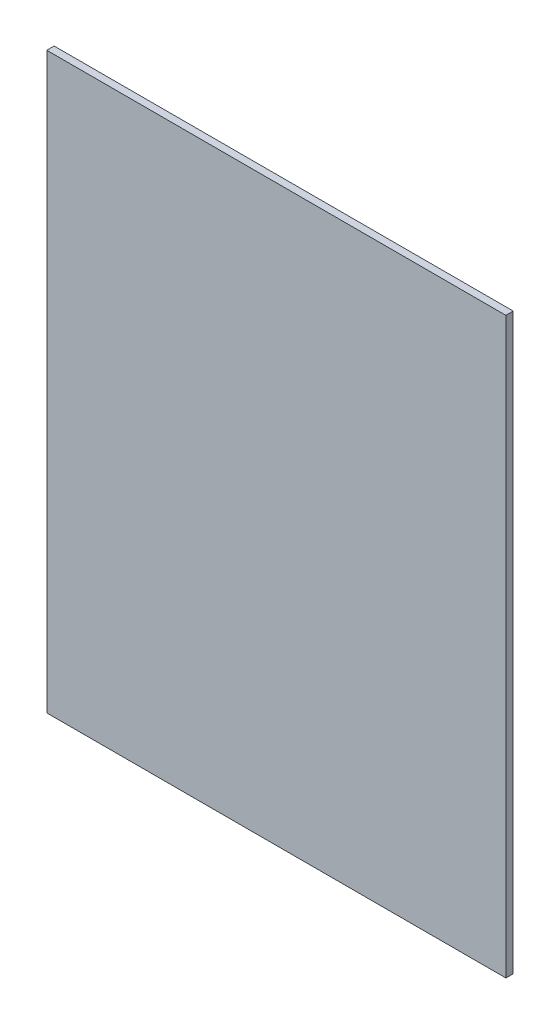
ISO-10303-21;
HEADER;
FILE_DESCRIPTION(('STEP AP214'),'2;1');
FILE_NAME('part.step','',(''),(''),'','','');
FILE_SCHEMA(('AUTOMOTIVE_DESIGN { 1 0 10303 214 1 1 1 1 }'));
ENDSEC;
DATA;
#1=APPLICATION_CONTEXT('core data for automotive mechanical design processes');
#2=APPLICATION_PROTOCOL_DEFINITION('international standard','automotive_design',2000,#1);
#3=PRODUCT_CONTEXT('',#1,'mechanical');
#4=PRODUCT('Part','Part','',(#3));
#5=PRODUCT_RELATED_PRODUCT_CATEGORY('part','',(#4));
#6=PRODUCT_DEFINITION_FORMATION('','',#4);
#7=PRODUCT_DEFINITION_CONTEXT('part definition',#1,'design');
#8=PRODUCT_DEFINITION('design','',#6,#7);
#9=PRODUCT_DEFINITION_SHAPE('','',#8);
#10=(LENGTH_UNIT() NAMED_UNIT(*) SI_UNIT(.MILLI.,.METRE.));
#11=(NAMED_UNIT(*) PLANE_ANGLE_UNIT() SI_UNIT($,.RADIAN.));
#12=(NAMED_UNIT(*) SI_UNIT($,.STERADIAN.) SOLID_ANGLE_UNIT());
#13=UNCERTAINTY_MEASURE_WITH_UNIT(LENGTH_MEASURE(1.E-05),#10,'distance_accuracy_value','');
#14=(GEOMETRIC_REPRESENTATION_CONTEXT(3) GLOBAL_UNCERTAINTY_ASSIGNED_CONTEXT((#13)) GLOBAL_UNIT_ASSIGNED_CONTEXT((#10,
#11,#12)) REPRESENTATION_CONTEXT('',''));
#15=CARTESIAN_POINT('',(0.,0.,0.));
#16=DIRECTION('',(0.,0.,1.));
#17=DIRECTION('',(1.,0.,0.));
#18=AXIS2_PLACEMENT_3D('',#15,#16,#17);
#19=CARTESIAN_POINT('',(99.06,-123.825,3.175));
#20=DIRECTION('',(-1.,0.,0.));
#21=DIRECTION('',(0.,0.,1.));
#22=AXIS2_PLACEMENT_3D('',#19,#20,#21);
#23=PLANE('',#22);
#24=DIRECTION('',(0.,1.,0.));
#25=VECTOR('',#24,1.);
#26=CARTESIAN_POINT('',(99.06,-123.825,0.));
#27=LINE('',#26,#25);
#28=CARTESIAN_POINT('',(99.06,-123.825,0.));
#29=VERTEX_POINT('',#28);
#30=CARTESIAN_POINT('',(99.06,123.825,0.));
#31=VERTEX_POINT('',#30);
#32=EDGE_CURVE('E99',#29,#31,#27,.T.);
#33=ORIENTED_EDGE('',*,*,#32,.T.);
#34=DIRECTION('',(0.,0.,-1.));
#35=VECTOR('',#34,1.);
#36=CARTESIAN_POINT('',(99.06,123.825,3.175));
#37=LINE('',#36,#35);
#38=CARTESIAN_POINT('',(99.06,123.825,3.175));
#39=VERTEX_POINT('',#38);
#40=EDGE_CURVE('E11',#39,#31,#37,.T.);
#41=ORIENTED_EDGE('',*,*,#40,.F.);
#42=DIRECTION('',(0.,1.,0.));
#43=VECTOR('',#42,1.);
#44=CARTESIAN_POINT('',(99.06,-123.825,3.175));
#45=LINE('',#44,#43);
#46=CARTESIAN_POINT('',(99.06,-123.825,3.175));
#47=VERTEX_POINT('',#46);
#48=EDGE_CURVE('E87',#47,#39,#45,.T.);
#49=ORIENTED_EDGE('',*,*,#48,.F.);
#50=DIRECTION('',(0.,0.,-1.));
#51=VECTOR('',#50,1.);
#52=CARTESIAN_POINT('',(99.06,-123.825,3.175));
#53=LINE('',#52,#51);
#54=EDGE_CURVE('E95',#47,#29,#53,.T.);
#55=ORIENTED_EDGE('',*,*,#54,.T.);
#56=EDGE_LOOP('',(#33,#41,#49,#55));
#57=FACE_BOUND('',#56,.T.);
#58=ADVANCED_FACE('F36',(#57),#23,.F.);
#59=CARTESIAN_POINT('',(-99.06,123.825,3.175));
#60=DIRECTION('',(0.,-1.,0.));
#61=DIRECTION('',(0.,0.,-1.));
#62=AXIS2_PLACEMENT_3D('',#59,#60,#61);
#63=PLANE('',#62);
#64=DIRECTION('',(-1.,0.,0.));
#65=VECTOR('',#64,1.);
#66=CARTESIAN_POINT('',(-99.06,123.825,0.));
#67=LINE('',#66,#65);
#68=CARTESIAN_POINT('',(-99.06,123.825,0.));
#69=VERTEX_POINT('',#68);
#70=EDGE_CURVE('E91',#31,#69,#67,.T.);
#71=ORIENTED_EDGE('',*,*,#70,.T.);
#72=DIRECTION('',(0.,0.,-1.));
#73=VECTOR('',#72,1.);
#74=CARTESIAN_POINT('',(-99.06,123.825,3.175));
#75=LINE('',#74,#73);
#76=CARTESIAN_POINT('',(-99.06,123.825,3.175));
#77=VERTEX_POINT('',#76);
#78=EDGE_CURVE('E44',#77,#69,#75,.T.);
#79=ORIENTED_EDGE('',*,*,#78,.F.);
#80=DIRECTION('',(-1.,0.,0.));
#81=VECTOR('',#80,1.);
#82=CARTESIAN_POINT('',(-99.06,123.825,3.175));
#83=LINE('',#82,#81);
#84=EDGE_CURVE('E82',#39,#77,#83,.T.);
#85=ORIENTED_EDGE('',*,*,#84,.F.);
#86=ORIENTED_EDGE('',*,*,#40,.T.);
#87=EDGE_LOOP('',(#71,#79,#85,#86));
#88=FACE_BOUND('',#87,.T.);
#89=ADVANCED_FACE('F90',(#88),#63,.F.);
#90=CARTESIAN_POINT('',(-99.06,-123.825,3.175));
#91=DIRECTION('',(1.,0.,0.));
#92=DIRECTION('',(0.,0.,-1.));
#93=AXIS2_PLACEMENT_3D('',#90,#91,#92);
#94=PLANE('',#93);
#95=DIRECTION('',(0.,-1.,0.));
#96=VECTOR('',#95,1.);
#97=CARTESIAN_POINT('',(-99.06,-123.825,0.));
#98=LINE('',#97,#96);
#99=CARTESIAN_POINT('',(-99.06,-123.825,0.));
#100=VERTEX_POINT('',#99);
#101=EDGE_CURVE('E69',#69,#100,#98,.T.);
#102=ORIENTED_EDGE('',*,*,#101,.T.);
#103=DIRECTION('',(0.,0.,-1.));
#104=VECTOR('',#103,1.);
#105=CARTESIAN_POINT('',(-99.06,-123.825,3.175));
#106=LINE('',#105,#104);
#107=CARTESIAN_POINT('',(-99.06,-123.825,3.175));
#108=VERTEX_POINT('',#107);
#109=EDGE_CURVE('E92',#108,#100,#106,.T.);
#110=ORIENTED_EDGE('',*,*,#109,.F.);
#111=DIRECTION('',(0.,-1.,0.));
#112=VECTOR('',#111,1.);
#113=CARTESIAN_POINT('',(-99.06,-123.825,3.175));
#114=LINE('',#113,#112);
#115=EDGE_CURVE('E85',#77,#108,#114,.T.);
#116=ORIENTED_EDGE('',*,*,#115,.F.);
#117=ORIENTED_EDGE('',*,*,#78,.T.);
#118=EDGE_LOOP('',(#102,#110,#116,#117));
#119=FACE_BOUND('',#118,.T.);
#120=ADVANCED_FACE('F93',(#119),#94,.F.);
#121=CARTESIAN_POINT('',(-99.06,-123.825,3.175));
#122=DIRECTION('',(0.,1.,0.));
#123=DIRECTION('',(0.,0.,1.));
#124=AXIS2_PLACEMENT_3D('',#121,#122,#123);
#125=PLANE('',#124);
#126=DIRECTION('',(1.,0.,0.));
#127=VECTOR('',#126,1.);
#128=CARTESIAN_POINT('',(-99.06,-123.825,0.));
#129=LINE('',#128,#127);
#130=EDGE_CURVE('E75',#100,#29,#129,.T.);
#131=ORIENTED_EDGE('',*,*,#130,.T.);
#132=ORIENTED_EDGE('',*,*,#54,.F.);
#133=DIRECTION('',(1.,0.,0.));
#134=VECTOR('',#133,1.);
#135=CARTESIAN_POINT('',(-99.06,-123.825,3.175));
#136=LINE('',#135,#134);
#137=EDGE_CURVE('E52',#108,#47,#136,.T.);
#138=ORIENTED_EDGE('',*,*,#137,.F.);
#139=ORIENTED_EDGE('',*,*,#109,.T.);
#140=EDGE_LOOP('',(#131,#132,#138,#139));
#141=FACE_BOUND('',#140,.T.);
#142=ADVANCED_FACE('F106',(#141),#125,.F.);
#143=CARTESIAN_POINT('',(0.,0.,3.175));
#144=DIRECTION('',(0.,0.,-1.));
#145=DIRECTION('',(-1.,0.,0.));
#146=AXIS2_PLACEMENT_3D('',#143,#144,#145);
#147=PLANE('',#146);
#148=ORIENTED_EDGE('',*,*,#48,.T.);
#149=ORIENTED_EDGE('',*,*,#84,.T.);
#150=ORIENTED_EDGE('',*,*,#115,.T.);
#151=ORIENTED_EDGE('',*,*,#137,.T.);
#152=EDGE_LOOP('',(#148,#149,#150,#151));
#153=FACE_BOUND('',#152,.T.);
#154=ADVANCED_FACE('F83',(#153),#147,.F.);
#155=CARTESIAN_POINT('',(0.,0.,0.));
#156=DIRECTION('',(0.,0.,-1.));
#157=DIRECTION('',(-1.,0.,0.));
#158=AXIS2_PLACEMENT_3D('',#155,#156,#157);
#159=PLANE('',#158);
#160=ORIENTED_EDGE('',*,*,#32,.F.);
#161=ORIENTED_EDGE('',*,*,#130,.F.);
#162=ORIENTED_EDGE('',*,*,#101,.F.);
#163=ORIENTED_EDGE('',*,*,#70,.F.);
#164=EDGE_LOOP('',(#160,#161,#162,#163));
#165=FACE_BOUND('',#164,.T.);
#166=ADVANCED_FACE('F109',(#165),#159,.T.);
#167=CLOSED_SHELL('',(#58,#89,#120,#142,#154,#166));
#168=MANIFOLD_SOLID_BREP('B2',#167);
#169=ADVANCED_BREP_SHAPE_REPRESENTATION('',(#18,#168),#14);
#170=SHAPE_DEFINITION_REPRESENTATION(#9,#169);
ENDSEC;
END-ISO-10303-21;
